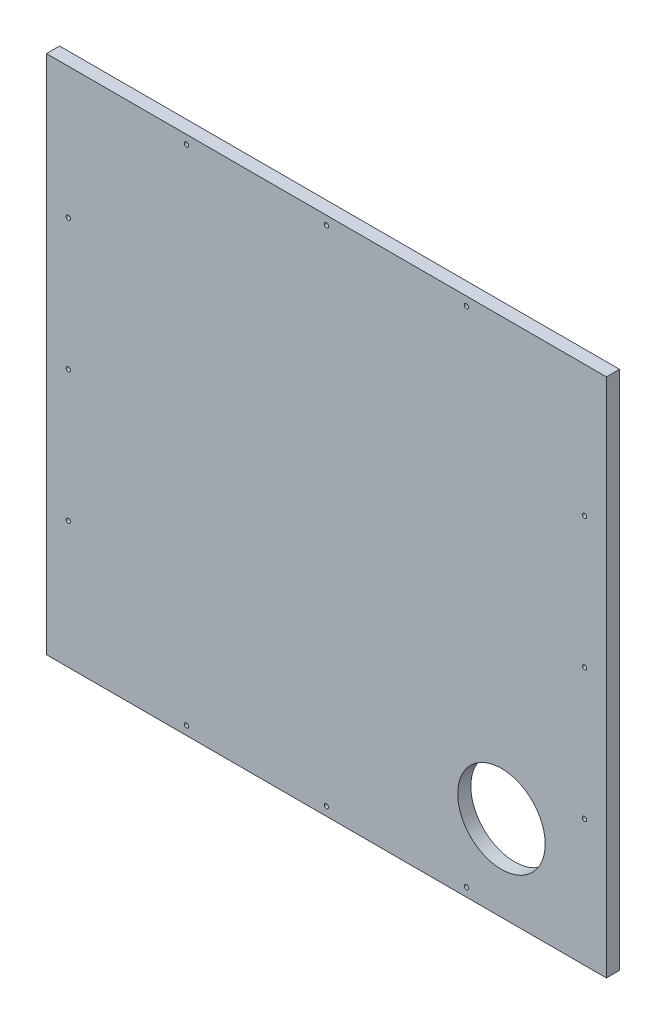
ISO-10303-21;
HEADER;
FILE_DESCRIPTION(('STEP AP214'),'2;1');
FILE_NAME('part.step','',(''),(''),'','','');
FILE_SCHEMA(('AUTOMOTIVE_DESIGN { 1 0 10303 214 1 1 1 1 }'));
ENDSEC;
DATA;
#1=APPLICATION_CONTEXT('core data for automotive mechanical design processes');
#2=APPLICATION_PROTOCOL_DEFINITION('international standard','automotive_design',2000,#1);
#3=PRODUCT_CONTEXT('',#1,'mechanical');
#4=PRODUCT('Part','Part','',(#3));
#5=PRODUCT_RELATED_PRODUCT_CATEGORY('part','',(#4));
#6=PRODUCT_DEFINITION_FORMATION('','',#4);
#7=PRODUCT_DEFINITION_CONTEXT('part definition',#1,'design');
#8=PRODUCT_DEFINITION('design','',#6,#7);
#9=PRODUCT_DEFINITION_SHAPE('','',#8);
#10=(LENGTH_UNIT() NAMED_UNIT(*) SI_UNIT(.MILLI.,.METRE.));
#11=(NAMED_UNIT(*) PLANE_ANGLE_UNIT() SI_UNIT($,.RADIAN.));
#12=(NAMED_UNIT(*) SI_UNIT($,.STERADIAN.) SOLID_ANGLE_UNIT());
#13=UNCERTAINTY_MEASURE_WITH_UNIT(LENGTH_MEASURE(1.E-05),#10,'distance_accuracy_value','');
#14=(GEOMETRIC_REPRESENTATION_CONTEXT(3) GLOBAL_UNCERTAINTY_ASSIGNED_CONTEXT((#13)) GLOBAL_UNIT_ASSIGNED_CONTEXT((#10,
#11,#12)) REPRESENTATION_CONTEXT('',''));
#15=CARTESIAN_POINT('',(0.,0.,0.));
#16=DIRECTION('',(0.,0.,1.));
#17=DIRECTION('',(1.,0.,0.));
#18=AXIS2_PLACEMENT_3D('',#15,#16,#17);
#19=CARTESIAN_POINT('',(320.,297.5,15.));
#20=DIRECTION('',(-1.,0.,0.));
#21=DIRECTION('',(0.,-1.,0.));
#22=AXIS2_PLACEMENT_3D('',#19,#20,#21);
#23=PLANE('',#22);
#24=DIRECTION('',(0.,1.,0.));
#25=VECTOR('',#24,1.);
#26=CARTESIAN_POINT('',(320.,297.5,0.));
#27=LINE('',#26,#25);
#28=CARTESIAN_POINT('',(320.,-297.5,0.));
#29=VERTEX_POINT('',#28);
#30=CARTESIAN_POINT('',(320.,297.5,0.));
#31=VERTEX_POINT('',#30);
#32=EDGE_CURVE('E100',#29,#31,#27,.T.);
#33=ORIENTED_EDGE('',*,*,#32,.T.);
#34=DIRECTION('',(0.,0.,-1.));
#35=VECTOR('',#34,1.);
#36=CARTESIAN_POINT('',(320.,297.5,15.));
#37=LINE('',#36,#35);
#38=CARTESIAN_POINT('',(320.,297.5,15.));
#39=VERTEX_POINT('',#38);
#40=EDGE_CURVE('E11',#39,#31,#37,.T.);
#41=ORIENTED_EDGE('',*,*,#40,.F.);
#42=DIRECTION('',(0.,1.,0.));
#43=VECTOR('',#42,1.);
#44=CARTESIAN_POINT('',(320.,297.5,15.));
#45=LINE('',#44,#43);
#46=CARTESIAN_POINT('',(320.,-297.5,15.));
#47=VERTEX_POINT('',#46);
#48=EDGE_CURVE('E88',#47,#39,#45,.T.);
#49=ORIENTED_EDGE('',*,*,#48,.F.);
#50=DIRECTION('',(0.,0.,-1.));
#51=VECTOR('',#50,1.);
#52=CARTESIAN_POINT('',(320.,-297.5,15.));
#53=LINE('',#52,#51);
#54=EDGE_CURVE('E96',#47,#29,#53,.T.);
#55=ORIENTED_EDGE('',*,*,#54,.T.);
#56=EDGE_LOOP('',(#33,#41,#49,#55));
#57=FACE_BOUND('',#56,.T.);
#58=ADVANCED_FACE('F37',(#57),#23,.F.);
#59=CARTESIAN_POINT('',(-320.,297.5,15.));
#60=DIRECTION('',(0.,-1.,0.));
#61=DIRECTION('',(0.,0.,-1.));
#62=AXIS2_PLACEMENT_3D('',#59,#60,#61);
#63=PLANE('',#62);
#64=DIRECTION('',(-1.,0.,0.));
#65=VECTOR('',#64,1.);
#66=CARTESIAN_POINT('',(-320.,297.5,0.));
#67=LINE('',#66,#65);
#68=CARTESIAN_POINT('',(-320.,297.5,0.));
#69=VERTEX_POINT('',#68);
#70=EDGE_CURVE('E92',#31,#69,#67,.T.);
#71=ORIENTED_EDGE('',*,*,#70,.T.);
#72=DIRECTION('',(0.,0.,-1.));
#73=VECTOR('',#72,1.);
#74=CARTESIAN_POINT('',(-320.,297.5,15.));
#75=LINE('',#74,#73);
#76=CARTESIAN_POINT('',(-320.,297.5,15.));
#77=VERTEX_POINT('',#76);
#78=EDGE_CURVE('E45',#77,#69,#75,.T.);
#79=ORIENTED_EDGE('',*,*,#78,.F.);
#80=DIRECTION('',(-1.,0.,0.));
#81=VECTOR('',#80,1.);
#82=CARTESIAN_POINT('',(-320.,297.5,15.));
#83=LINE('',#82,#81);
#84=EDGE_CURVE('E83',#39,#77,#83,.T.);
#85=ORIENTED_EDGE('',*,*,#84,.F.);
#86=ORIENTED_EDGE('',*,*,#40,.T.);
#87=EDGE_LOOP('',(#71,#79,#85,#86));
#88=FACE_BOUND('',#87,.T.);
#89=ADVANCED_FACE('F91',(#88),#63,.F.);
#90=CARTESIAN_POINT('',(-320.,297.5,15.));
#91=DIRECTION('',(1.,0.,0.));
#92=DIRECTION('',(0.,0.,-1.));
#93=AXIS2_PLACEMENT_3D('',#90,#91,#92);
#94=PLANE('',#93);
#95=DIRECTION('',(0.,-1.,0.));
#96=VECTOR('',#95,1.);
#97=CARTESIAN_POINT('',(-320.,297.5,0.));
#98=LINE('',#97,#96);
#99=CARTESIAN_POINT('',(-320.,-297.5,0.));
#100=VERTEX_POINT('',#99);
#101=EDGE_CURVE('E70',#69,#100,#98,.T.);
#102=ORIENTED_EDGE('',*,*,#101,.T.);
#103=DIRECTION('',(0.,0.,-1.));
#104=VECTOR('',#103,1.);
#105=CARTESIAN_POINT('',(-320.,-297.5,15.));
#106=LINE('',#105,#104);
#107=CARTESIAN_POINT('',(-320.,-297.5,15.));
#108=VERTEX_POINT('',#107);
#109=EDGE_CURVE('E93',#108,#100,#106,.T.);
#110=ORIENTED_EDGE('',*,*,#109,.F.);
#111=DIRECTION('',(0.,-1.,0.));
#112=VECTOR('',#111,1.);
#113=CARTESIAN_POINT('',(-320.,297.5,15.));
#114=LINE('',#113,#112);
#115=EDGE_CURVE('E86',#77,#108,#114,.T.);
#116=ORIENTED_EDGE('',*,*,#115,.F.);
#117=ORIENTED_EDGE('',*,*,#78,.T.);
#118=EDGE_LOOP('',(#102,#110,#116,#117));
#119=FACE_BOUND('',#118,.T.);
#120=ADVANCED_FACE('F94',(#119),#94,.F.);
#121=CARTESIAN_POINT('',(-320.,-297.5,15.));
#122=DIRECTION('',(0.,1.,0.));
#123=DIRECTION('',(0.,0.,1.));
#124=AXIS2_PLACEMENT_3D('',#121,#122,#123);
#125=PLANE('',#124);
#126=DIRECTION('',(1.,0.,0.));
#127=VECTOR('',#126,1.);
#128=CARTESIAN_POINT('',(-320.,-297.5,0.));
#129=LINE('',#128,#127);
#130=EDGE_CURVE('E76',#100,#29,#129,.T.);
#131=ORIENTED_EDGE('',*,*,#130,.T.);
#132=ORIENTED_EDGE('',*,*,#54,.F.);
#133=DIRECTION('',(1.,0.,0.));
#134=VECTOR('',#133,1.);
#135=CARTESIAN_POINT('',(-320.,-297.5,15.));
#136=LINE('',#135,#134);
#137=EDGE_CURVE('E53',#108,#47,#136,.T.);
#138=ORIENTED_EDGE('',*,*,#137,.F.);
#139=ORIENTED_EDGE('',*,*,#109,.T.);
#140=EDGE_LOOP('',(#131,#132,#138,#139));
#141=FACE_BOUND('',#140,.T.);
#142=ADVANCED_FACE('F108',(#141),#125,.F.);
#143=CARTESIAN_POINT('',(0.,0.,15.));
#144=DIRECTION('',(0.,0.,1.));
#145=DIRECTION('',(1.,0.,0.));
#146=AXIS2_PLACEMENT_3D('',#143,#144,#145);
#147=PLANE('',#146);
#148=CARTESIAN_POINT('',(200.,-200.,15.));
#149=DIRECTION('',(0.,0.,1.));
#150=DIRECTION('',(1.,0.,0.));
#151=AXIS2_PLACEMENT_3D('',#148,#149,#150);
#152=CIRCLE('',#151,50.);
#153=CARTESIAN_POINT('',(250.,-200.,15.));
#154=VERTEX_POINT('',#153);
#155=EDGE_CURVE('E186',#154,#154,#152,.T.);
#156=ORIENTED_EDGE('',*,*,#155,.F.);
#157=EDGE_LOOP('',(#156));
#158=FACE_BOUND('',#157,.T.);
#159=CARTESIAN_POINT('',(295.,147.5,15.));
#160=DIRECTION('',(0.,0.,-1.));
#161=DIRECTION('',(-1.,0.,0.));
#162=AXIS2_PLACEMENT_3D('',#159,#160,#161);
#163=CIRCLE('',#162,2.50000000000002);
#164=CARTESIAN_POINT('',(292.5,147.5,15.));
#165=VERTEX_POINT('',#164);
#166=EDGE_CURVE('E181',#165,#165,#163,.T.);
#167=ORIENTED_EDGE('',*,*,#166,.T.);
#168=EDGE_LOOP('',(#167));
#169=FACE_BOUND('',#168,.T.);
#170=CARTESIAN_POINT('',(295.,-2.50000000000006,15.));
#171=DIRECTION('',(0.,0.,-1.));
#172=DIRECTION('',(-1.,0.,0.));
#173=AXIS2_PLACEMENT_3D('',#170,#171,#172);
#174=CIRCLE('',#173,2.50000000000002);
#175=CARTESIAN_POINT('',(292.5,-2.50000000000006,15.));
#176=VERTEX_POINT('',#175);
#177=EDGE_CURVE('E175',#176,#176,#174,.T.);
#178=ORIENTED_EDGE('',*,*,#177,.T.);
#179=EDGE_LOOP('',(#178));
#180=FACE_BOUND('',#179,.T.);
#181=CARTESIAN_POINT('',(295.,-152.5,15.));
#182=DIRECTION('',(0.,0.,-1.));
#183=DIRECTION('',(-1.,0.,0.));
#184=AXIS2_PLACEMENT_3D('',#181,#182,#183);
#185=CIRCLE('',#184,2.50000000000002);
#186=CARTESIAN_POINT('',(292.5,-152.5,15.));
#187=VERTEX_POINT('',#186);
#188=EDGE_CURVE('E168',#187,#187,#185,.T.);
#189=ORIENTED_EDGE('',*,*,#188,.T.);
#190=EDGE_LOOP('',(#189));
#191=FACE_BOUND('',#190,.T.);
#192=CARTESIAN_POINT('',(-160.,-287.5,15.));
#193=DIRECTION('',(0.,0.,-1.));
#194=DIRECTION('',(1.,0.,0.));
#195=AXIS2_PLACEMENT_3D('',#192,#193,#194);
#196=CIRCLE('',#195,2.5);
#197=CARTESIAN_POINT('',(-157.5,-287.5,15.));
#198=VERTEX_POINT('',#197);
#199=EDGE_CURVE('E163',#198,#198,#196,.T.);
#200=ORIENTED_EDGE('',*,*,#199,.T.);
#201=EDGE_LOOP('',(#200));
#202=FACE_BOUND('',#201,.T.);
#203=CARTESIAN_POINT('',(0.,-287.5,15.));
#204=DIRECTION('',(0.,0.,-1.));
#205=DIRECTION('',(1.,0.,0.));
#206=AXIS2_PLACEMENT_3D('',#203,#204,#205);
#207=CIRCLE('',#206,2.5);
#208=CARTESIAN_POINT('',(2.5,-287.5,15.));
#209=VERTEX_POINT('',#208);
#210=EDGE_CURVE('E157',#209,#209,#207,.T.);
#211=ORIENTED_EDGE('',*,*,#210,.T.);
#212=EDGE_LOOP('',(#211));
#213=FACE_BOUND('',#212,.T.);
#214=CARTESIAN_POINT('',(160.,-287.5,15.));
#215=DIRECTION('',(0.,0.,-1.));
#216=DIRECTION('',(1.,0.,0.));
#217=AXIS2_PLACEMENT_3D('',#214,#215,#216);
#218=CIRCLE('',#217,2.5);
#219=CARTESIAN_POINT('',(162.5,-287.5,15.));
#220=VERTEX_POINT('',#219);
#221=EDGE_CURVE('E150',#220,#220,#218,.T.);
#222=ORIENTED_EDGE('',*,*,#221,.T.);
#223=EDGE_LOOP('',(#222));
#224=FACE_BOUND('',#223,.T.);
#225=CARTESIAN_POINT('',(-295.,147.5,15.));
#226=DIRECTION('',(0.,0.,1.));
#227=DIRECTION('',(1.,0.,0.));
#228=AXIS2_PLACEMENT_3D('',#225,#226,#227);
#229=CIRCLE('',#228,2.50000000000002);
#230=CARTESIAN_POINT('',(-292.5,147.5,15.));
#231=VERTEX_POINT('',#230);
#232=EDGE_CURVE('E145',#231,#231,#229,.T.);
#233=ORIENTED_EDGE('',*,*,#232,.F.);
#234=EDGE_LOOP('',(#233));
#235=FACE_BOUND('',#234,.T.);
#236=CARTESIAN_POINT('',(-295.,-2.50000000000006,15.));
#237=DIRECTION('',(0.,0.,1.));
#238=DIRECTION('',(1.,0.,0.));
#239=AXIS2_PLACEMENT_3D('',#236,#237,#238);
#240=CIRCLE('',#239,2.50000000000002);
#241=CARTESIAN_POINT('',(-292.5,-2.50000000000006,15.));
#242=VERTEX_POINT('',#241);
#243=EDGE_CURVE('E142',#242,#242,#240,.T.);
#244=ORIENTED_EDGE('',*,*,#243,.F.);
#245=EDGE_LOOP('',(#244));
#246=FACE_BOUND('',#245,.T.);
#247=CARTESIAN_POINT('',(-295.,-152.5,15.));
#248=DIRECTION('',(0.,0.,1.));
#249=DIRECTION('',(1.,0.,0.));
#250=AXIS2_PLACEMENT_3D('',#247,#248,#249);
#251=CIRCLE('',#250,2.50000000000002);
#252=CARTESIAN_POINT('',(-292.5,-152.5,15.));
#253=VERTEX_POINT('',#252);
#254=EDGE_CURVE('E135',#253,#253,#251,.T.);
#255=ORIENTED_EDGE('',*,*,#254,.F.);
#256=EDGE_LOOP('',(#255));
#257=FACE_BOUND('',#256,.T.);
#258=CARTESIAN_POINT('',(-160.,287.5,15.));
#259=DIRECTION('',(0.,0.,1.));
#260=DIRECTION('',(1.,0.,0.));
#261=AXIS2_PLACEMENT_3D('',#258,#259,#260);
#262=CIRCLE('',#261,2.5);
#263=CARTESIAN_POINT('',(-157.5,287.5,15.));
#264=VERTEX_POINT('',#263);
#265=EDGE_CURVE('E127',#264,#264,#262,.T.);
#266=ORIENTED_EDGE('',*,*,#265,.F.);
#267=EDGE_LOOP('',(#266));
#268=FACE_BOUND('',#267,.T.);
#269=CARTESIAN_POINT('',(0.,287.5,15.));
#270=DIRECTION('',(0.,0.,1.));
#271=DIRECTION('',(1.,0.,0.));
#272=AXIS2_PLACEMENT_3D('',#269,#270,#271);
#273=CIRCLE('',#272,2.5);
#274=CARTESIAN_POINT('',(2.5,287.5,15.));
#275=VERTEX_POINT('',#274);
#276=EDGE_CURVE('E124',#275,#275,#273,.T.);
#277=ORIENTED_EDGE('',*,*,#276,.F.);
#278=EDGE_LOOP('',(#277));
#279=FACE_BOUND('',#278,.T.);
#280=CARTESIAN_POINT('',(160.,287.5,15.));
#281=DIRECTION('',(0.,0.,1.));
#282=DIRECTION('',(1.,0.,0.));
#283=AXIS2_PLACEMENT_3D('',#280,#281,#282);
#284=CIRCLE('',#283,2.5);
#285=CARTESIAN_POINT('',(162.5,287.5,15.));
#286=VERTEX_POINT('',#285);
#287=EDGE_CURVE('E117',#286,#286,#284,.T.);
#288=ORIENTED_EDGE('',*,*,#287,.F.);
#289=EDGE_LOOP('',(#288));
#290=FACE_BOUND('',#289,.T.);
#291=ORIENTED_EDGE('',*,*,#48,.T.);
#292=ORIENTED_EDGE('',*,*,#84,.T.);
#293=ORIENTED_EDGE('',*,*,#115,.T.);
#294=ORIENTED_EDGE('',*,*,#137,.T.);
#295=EDGE_LOOP('',(#291,#292,#293,#294));
#296=FACE_BOUND('',#295,.T.);
#297=ADVANCED_FACE('F84',(#158,#169,#180,#191,#202,#213,#224,#235,#246,#257,#268,#279,#290,
#296),#147,.T.);
#298=CARTESIAN_POINT('',(0.,0.,0.));
#299=DIRECTION('',(0.,0.,1.));
#300=DIRECTION('',(1.,0.,0.));
#301=AXIS2_PLACEMENT_3D('',#298,#299,#300);
#302=PLANE('',#301);
#303=CARTESIAN_POINT('',(200.,-200.,0.));
#304=DIRECTION('',(0.,0.,1.));
#305=DIRECTION('',(1.,0.,0.));
#306=AXIS2_PLACEMENT_3D('',#303,#304,#305);
#307=CIRCLE('',#306,50.);
#308=CARTESIAN_POINT('',(250.,-200.,0.));
#309=VERTEX_POINT('',#308);
#310=EDGE_CURVE('E172',#309,#309,#307,.T.);
#311=ORIENTED_EDGE('',*,*,#310,.T.);
#312=EDGE_LOOP('',(#311));
#313=FACE_BOUND('',#312,.T.);
#314=CARTESIAN_POINT('',(295.,147.5,0.));
#315=DIRECTION('',(0.,0.,-1.));
#316=DIRECTION('',(-1.,0.,0.));
#317=AXIS2_PLACEMENT_3D('',#314,#315,#316);
#318=CIRCLE('',#317,2.50000000000002);
#319=CARTESIAN_POINT('',(292.5,147.5,0.));
#320=VERTEX_POINT('',#319);
#321=EDGE_CURVE('E154',#320,#320,#318,.T.);
#322=ORIENTED_EDGE('',*,*,#321,.F.);
#323=EDGE_LOOP('',(#322));
#324=FACE_BOUND('',#323,.T.);
#325=CARTESIAN_POINT('',(295.,-2.50000000000006,0.));
#326=DIRECTION('',(0.,0.,-1.));
#327=DIRECTION('',(-1.,0.,0.));
#328=AXIS2_PLACEMENT_3D('',#325,#326,#327);
#329=CIRCLE('',#328,2.50000000000002);
#330=CARTESIAN_POINT('',(292.5,-2.50000000000006,0.));
#331=VERTEX_POINT('',#330);
#332=EDGE_CURVE('E178',#331,#331,#329,.T.);
#333=ORIENTED_EDGE('',*,*,#332,.F.);
#334=EDGE_LOOP('',(#333));
#335=FACE_BOUND('',#334,.T.);
#336=CARTESIAN_POINT('',(295.,-152.5,0.));
#337=DIRECTION('',(0.,0.,-1.));
#338=DIRECTION('',(-1.,0.,0.));
#339=AXIS2_PLACEMENT_3D('',#336,#337,#338);
#340=CIRCLE('',#339,2.50000000000002);
#341=CARTESIAN_POINT('',(292.5,-152.5,0.));
#342=VERTEX_POINT('',#341);
#343=EDGE_CURVE('E171',#342,#342,#340,.T.);
#344=ORIENTED_EDGE('',*,*,#343,.F.);
#345=EDGE_LOOP('',(#344));
#346=FACE_BOUND('',#345,.T.);
#347=CARTESIAN_POINT('',(-160.,-287.5,0.));
#348=DIRECTION('',(0.,0.,-1.));
#349=DIRECTION('',(1.,0.,0.));
#350=AXIS2_PLACEMENT_3D('',#347,#348,#349);
#351=CIRCLE('',#350,2.5);
#352=CARTESIAN_POINT('',(-157.5,-287.5,0.));
#353=VERTEX_POINT('',#352);
#354=EDGE_CURVE('E136',#353,#353,#351,.T.);
#355=ORIENTED_EDGE('',*,*,#354,.F.);
#356=EDGE_LOOP('',(#355));
#357=FACE_BOUND('',#356,.T.);
#358=CARTESIAN_POINT('',(0.,-287.5,0.));
#359=DIRECTION('',(0.,0.,-1.));
#360=DIRECTION('',(1.,0.,0.));
#361=AXIS2_PLACEMENT_3D('',#358,#359,#360);
#362=CIRCLE('',#361,2.5);
#363=CARTESIAN_POINT('',(2.5,-287.5,0.));
#364=VERTEX_POINT('',#363);
#365=EDGE_CURVE('E160',#364,#364,#362,.T.);
#366=ORIENTED_EDGE('',*,*,#365,.F.);
#367=EDGE_LOOP('',(#366));
#368=FACE_BOUND('',#367,.T.);
#369=CARTESIAN_POINT('',(160.,-287.5,0.));
#370=DIRECTION('',(0.,0.,-1.));
#371=DIRECTION('',(1.,0.,0.));
#372=AXIS2_PLACEMENT_3D('',#369,#370,#371);
#373=CIRCLE('',#372,2.5);
#374=CARTESIAN_POINT('',(162.5,-287.5,0.));
#375=VERTEX_POINT('',#374);
#376=EDGE_CURVE('E153',#375,#375,#373,.T.);
#377=ORIENTED_EDGE('',*,*,#376,.F.);
#378=EDGE_LOOP('',(#377));
#379=FACE_BOUND('',#378,.T.);
#380=CARTESIAN_POINT('',(-295.,147.5,0.));
#381=DIRECTION('',(0.,0.,1.));
#382=DIRECTION('',(1.,0.,0.));
#383=AXIS2_PLACEMENT_3D('',#380,#381,#382);
#384=CIRCLE('',#383,2.50000000000002);
#385=CARTESIAN_POINT('',(-292.5,147.5,0.));
#386=VERTEX_POINT('',#385);
#387=EDGE_CURVE('E118',#386,#386,#384,.T.);
#388=ORIENTED_EDGE('',*,*,#387,.T.);
#389=EDGE_LOOP('',(#388));
#390=FACE_BOUND('',#389,.T.);
#391=CARTESIAN_POINT('',(-295.,-2.50000000000006,0.));
#392=DIRECTION('',(0.,0.,1.));
#393=DIRECTION('',(1.,0.,0.));
#394=AXIS2_PLACEMENT_3D('',#391,#392,#393);
#395=CIRCLE('',#394,2.50000000000002);
#396=CARTESIAN_POINT('',(-292.5,-2.50000000000006,0.));
#397=VERTEX_POINT('',#396);
#398=EDGE_CURVE('E139',#397,#397,#395,.T.);
#399=ORIENTED_EDGE('',*,*,#398,.T.);
#400=EDGE_LOOP('',(#399));
#401=FACE_BOUND('',#400,.T.);
#402=CARTESIAN_POINT('',(-295.,-152.5,0.));
#403=DIRECTION('',(0.,0.,1.));
#404=DIRECTION('',(1.,0.,0.));
#405=AXIS2_PLACEMENT_3D('',#402,#403,#404);
#406=CIRCLE('',#405,2.50000000000002);
#407=CARTESIAN_POINT('',(-292.5,-152.5,0.));
#408=VERTEX_POINT('',#407);
#409=EDGE_CURVE('E132',#408,#408,#406,.T.);
#410=ORIENTED_EDGE('',*,*,#409,.T.);
#411=EDGE_LOOP('',(#410));
#412=FACE_BOUND('',#411,.T.);
#413=CARTESIAN_POINT('',(-160.,287.5,0.));
#414=DIRECTION('',(0.,0.,1.));
#415=DIRECTION('',(1.,0.,0.));
#416=AXIS2_PLACEMENT_3D('',#413,#414,#415);
#417=CIRCLE('',#416,2.5);
#418=CARTESIAN_POINT('',(-157.5,287.5,0.));
#419=VERTEX_POINT('',#418);
#420=EDGE_CURVE('E103',#419,#419,#417,.T.);
#421=ORIENTED_EDGE('',*,*,#420,.T.);
#422=EDGE_LOOP('',(#421));
#423=FACE_BOUND('',#422,.T.);
#424=CARTESIAN_POINT('',(0.,287.5,0.));
#425=DIRECTION('',(0.,0.,1.));
#426=DIRECTION('',(1.,0.,0.));
#427=AXIS2_PLACEMENT_3D('',#424,#425,#426);
#428=CIRCLE('',#427,2.5);
#429=CARTESIAN_POINT('',(2.5,287.5,0.));
#430=VERTEX_POINT('',#429);
#431=EDGE_CURVE('E121',#430,#430,#428,.T.);
#432=ORIENTED_EDGE('',*,*,#431,.T.);
#433=EDGE_LOOP('',(#432));
#434=FACE_BOUND('',#433,.T.);
#435=CARTESIAN_POINT('',(160.,287.5,0.));
#436=DIRECTION('',(0.,0.,1.));
#437=DIRECTION('',(1.,0.,0.));
#438=AXIS2_PLACEMENT_3D('',#435,#436,#437);
#439=CIRCLE('',#438,2.5);
#440=CARTESIAN_POINT('',(162.5,287.5,0.));
#441=VERTEX_POINT('',#440);
#442=EDGE_CURVE('E114',#441,#441,#439,.T.);
#443=ORIENTED_EDGE('',*,*,#442,.T.);
#444=EDGE_LOOP('',(#443));
#445=FACE_BOUND('',#444,.T.);
#446=ORIENTED_EDGE('',*,*,#32,.F.);
#447=ORIENTED_EDGE('',*,*,#130,.F.);
#448=ORIENTED_EDGE('',*,*,#101,.F.);
#449=ORIENTED_EDGE('',*,*,#70,.F.);
#450=EDGE_LOOP('',(#446,#447,#448,#449));
#451=FACE_BOUND('',#450,.T.);
#452=ADVANCED_FACE('F111',(#313,#324,#335,#346,#357,#368,#379,#390,#401,#412,#423,#434,#445,
#451),#302,.F.);
#453=CARTESIAN_POINT('',(160.,287.5,0.));
#454=DIRECTION('',(0.,0.,1.));
#455=DIRECTION('',(1.,0.,0.));
#456=AXIS2_PLACEMENT_3D('',#453,#454,#455);
#457=CYLINDRICAL_SURFACE('',#456,2.5);
#458=ORIENTED_EDGE('',*,*,#442,.F.);
#459=EDGE_LOOP('',(#458));
#460=FACE_BOUND('',#459,.T.);
#461=ORIENTED_EDGE('',*,*,#287,.T.);
#462=EDGE_LOOP('',(#461));
#463=FACE_BOUND('',#462,.T.);
#464=ADVANCED_FACE('F228',(#460,#463),#457,.F.);
#465=CARTESIAN_POINT('',(0.,287.5,0.));
#466=DIRECTION('',(0.,0.,1.));
#467=DIRECTION('',(1.,0.,0.));
#468=AXIS2_PLACEMENT_3D('',#465,#466,#467);
#469=CYLINDRICAL_SURFACE('',#468,2.5);
#470=ORIENTED_EDGE('',*,*,#431,.F.);
#471=EDGE_LOOP('',(#470));
#472=FACE_BOUND('',#471,.T.);
#473=ORIENTED_EDGE('',*,*,#276,.T.);
#474=EDGE_LOOP('',(#473));
#475=FACE_BOUND('',#474,.T.);
#476=ADVANCED_FACE('F230',(#472,#475),#469,.F.);
#477=CARTESIAN_POINT('',(-160.,287.5,0.));
#478=DIRECTION('',(0.,0.,1.));
#479=DIRECTION('',(1.,0.,0.));
#480=AXIS2_PLACEMENT_3D('',#477,#478,#479);
#481=CYLINDRICAL_SURFACE('',#480,2.5);
#482=ORIENTED_EDGE('',*,*,#420,.F.);
#483=EDGE_LOOP('',(#482));
#484=FACE_BOUND('',#483,.T.);
#485=ORIENTED_EDGE('',*,*,#265,.T.);
#486=EDGE_LOOP('',(#485));
#487=FACE_BOUND('',#486,.T.);
#488=ADVANCED_FACE('F237',(#484,#487),#481,.F.);
#489=CARTESIAN_POINT('',(-295.,-152.5,0.));
#490=DIRECTION('',(0.,0.,1.));
#491=DIRECTION('',(1.,0.,0.));
#492=AXIS2_PLACEMENT_3D('',#489,#490,#491);
#493=CYLINDRICAL_SURFACE('',#492,2.50000000000002);
#494=ORIENTED_EDGE('',*,*,#409,.F.);
#495=EDGE_LOOP('',(#494));
#496=FACE_BOUND('',#495,.T.);
#497=ORIENTED_EDGE('',*,*,#254,.T.);
#498=EDGE_LOOP('',(#497));
#499=FACE_BOUND('',#498,.T.);
#500=ADVANCED_FACE('F337',(#496,#499),#493,.F.);
#501=CARTESIAN_POINT('',(-295.,-2.50000000000006,0.));
#502=DIRECTION('',(0.,0.,1.));
#503=DIRECTION('',(1.,0.,0.));
#504=AXIS2_PLACEMENT_3D('',#501,#502,#503);
#505=CYLINDRICAL_SURFACE('',#504,2.50000000000002);
#506=ORIENTED_EDGE('',*,*,#398,.F.);
#507=EDGE_LOOP('',(#506));
#508=FACE_BOUND('',#507,.T.);
#509=ORIENTED_EDGE('',*,*,#243,.T.);
#510=EDGE_LOOP('',(#509));
#511=FACE_BOUND('',#510,.T.);
#512=ADVANCED_FACE('F329',(#508,#511),#505,.F.);
#513=CARTESIAN_POINT('',(-295.,147.5,0.));
#514=DIRECTION('',(0.,0.,1.));
#515=DIRECTION('',(1.,0.,0.));
#516=AXIS2_PLACEMENT_3D('',#513,#514,#515);
#517=CYLINDRICAL_SURFACE('',#516,2.50000000000002);
#518=ORIENTED_EDGE('',*,*,#387,.F.);
#519=EDGE_LOOP('',(#518));
#520=FACE_BOUND('',#519,.T.);
#521=ORIENTED_EDGE('',*,*,#232,.T.);
#522=EDGE_LOOP('',(#521));
#523=FACE_BOUND('',#522,.T.);
#524=ADVANCED_FACE('F321',(#520,#523),#517,.F.);
#525=CARTESIAN_POINT('',(160.,-287.5,0.));
#526=DIRECTION('',(0.,0.,1.));
#527=DIRECTION('',(1.,0.,0.));
#528=AXIS2_PLACEMENT_3D('',#525,#526,#527);
#529=CYLINDRICAL_SURFACE('',#528,2.5);
#530=ORIENTED_EDGE('',*,*,#376,.T.);
#531=EDGE_LOOP('',(#530));
#532=FACE_BOUND('',#531,.T.);
#533=ORIENTED_EDGE('',*,*,#221,.F.);
#534=EDGE_LOOP('',(#533));
#535=FACE_BOUND('',#534,.T.);
#536=ADVANCED_FACE('F313',(#532,#535),#529,.F.);
#537=CARTESIAN_POINT('',(0.,-287.5,0.));
#538=DIRECTION('',(0.,0.,1.));
#539=DIRECTION('',(1.,0.,0.));
#540=AXIS2_PLACEMENT_3D('',#537,#538,#539);
#541=CYLINDRICAL_SURFACE('',#540,2.5);
#542=ORIENTED_EDGE('',*,*,#365,.T.);
#543=EDGE_LOOP('',(#542));
#544=FACE_BOUND('',#543,.T.);
#545=ORIENTED_EDGE('',*,*,#210,.F.);
#546=EDGE_LOOP('',(#545));
#547=FACE_BOUND('',#546,.T.);
#548=ADVANCED_FACE('F305',(#544,#547),#541,.F.);
#549=CARTESIAN_POINT('',(-160.,-287.5,0.));
#550=DIRECTION('',(0.,0.,1.));
#551=DIRECTION('',(1.,0.,0.));
#552=AXIS2_PLACEMENT_3D('',#549,#550,#551);
#553=CYLINDRICAL_SURFACE('',#552,2.5);
#554=ORIENTED_EDGE('',*,*,#354,.T.);
#555=EDGE_LOOP('',(#554));
#556=FACE_BOUND('',#555,.T.);
#557=ORIENTED_EDGE('',*,*,#199,.F.);
#558=EDGE_LOOP('',(#557));
#559=FACE_BOUND('',#558,.T.);
#560=ADVANCED_FACE('F297',(#556,#559),#553,.F.);
#561=CARTESIAN_POINT('',(295.,-152.5,0.));
#562=DIRECTION('',(0.,0.,1.));
#563=DIRECTION('',(1.,0.,0.));
#564=AXIS2_PLACEMENT_3D('',#561,#562,#563);
#565=CYLINDRICAL_SURFACE('',#564,2.50000000000002);
#566=ORIENTED_EDGE('',*,*,#343,.T.);
#567=EDGE_LOOP('',(#566));
#568=FACE_BOUND('',#567,.T.);
#569=ORIENTED_EDGE('',*,*,#188,.F.);
#570=EDGE_LOOP('',(#569));
#571=FACE_BOUND('',#570,.T.);
#572=ADVANCED_FACE('F289',(#568,#571),#565,.F.);
#573=CARTESIAN_POINT('',(295.,-2.50000000000006,0.));
#574=DIRECTION('',(0.,0.,1.));
#575=DIRECTION('',(1.,0.,0.));
#576=AXIS2_PLACEMENT_3D('',#573,#574,#575);
#577=CYLINDRICAL_SURFACE('',#576,2.50000000000002);
#578=ORIENTED_EDGE('',*,*,#332,.T.);
#579=EDGE_LOOP('',(#578));
#580=FACE_BOUND('',#579,.T.);
#581=ORIENTED_EDGE('',*,*,#177,.F.);
#582=EDGE_LOOP('',(#581));
#583=FACE_BOUND('',#582,.T.);
#584=ADVANCED_FACE('F282',(#580,#583),#577,.F.);
#585=CARTESIAN_POINT('',(295.,147.5,0.));
#586=DIRECTION('',(0.,0.,1.));
#587=DIRECTION('',(1.,0.,0.));
#588=AXIS2_PLACEMENT_3D('',#585,#586,#587);
#589=CYLINDRICAL_SURFACE('',#588,2.50000000000002);
#590=ORIENTED_EDGE('',*,*,#321,.T.);
#591=EDGE_LOOP('',(#590));
#592=FACE_BOUND('',#591,.T.);
#593=ORIENTED_EDGE('',*,*,#166,.F.);
#594=EDGE_LOOP('',(#593));
#595=FACE_BOUND('',#594,.T.);
#596=ADVANCED_FACE('F197',(#592,#595),#589,.F.);
#597=CARTESIAN_POINT('',(200.,-200.,0.));
#598=DIRECTION('',(0.,0.,1.));
#599=DIRECTION('',(1.,0.,0.));
#600=AXIS2_PLACEMENT_3D('',#597,#598,#599);
#601=CYLINDRICAL_SURFACE('',#600,50.);
#602=ORIENTED_EDGE('',*,*,#310,.F.);
#603=EDGE_LOOP('',(#602));
#604=FACE_BOUND('',#603,.T.);
#605=ORIENTED_EDGE('',*,*,#155,.T.);
#606=EDGE_LOOP('',(#605));
#607=FACE_BOUND('',#606,.T.);
#608=ADVANCED_FACE('F194',(#604,#607),#601,.F.);
#609=CLOSED_SHELL('',(#58,#89,#120,#142,#297,#452,#464,#476,#488,#500,#512,#524,#536,#548,#560,
#572,#584,#596,#608));
#610=MANIFOLD_SOLID_BREP('B2',#609);
#611=ADVANCED_BREP_SHAPE_REPRESENTATION('',(#18,#610),#14);
#612=SHAPE_DEFINITION_REPRESENTATION(#9,#611);
ENDSEC;
END-ISO-10303-21;
